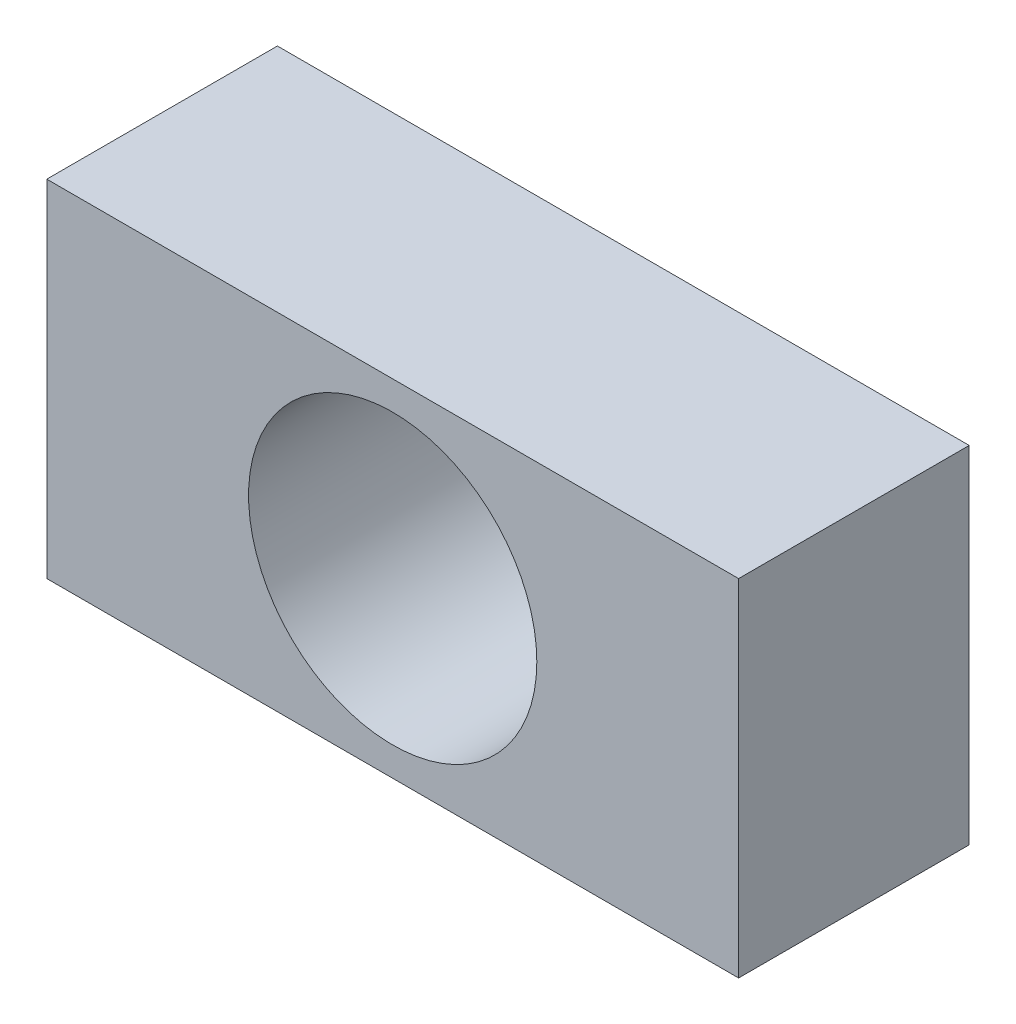
ISO-10303-21;
HEADER;
FILE_DESCRIPTION(('STEP AP214'),'2;1');
FILE_NAME('part.step','',(''),(''),'','','');
FILE_SCHEMA(('AUTOMOTIVE_DESIGN { 1 0 10303 214 1 1 1 1 }'));
ENDSEC;
DATA;
#1=APPLICATION_CONTEXT('core data for automotive mechanical design processes');
#2=APPLICATION_PROTOCOL_DEFINITION('international standard','automotive_design',2000,#1);
#3=PRODUCT_CONTEXT('',#1,'mechanical');
#4=PRODUCT('Part','Part','',(#3));
#5=PRODUCT_RELATED_PRODUCT_CATEGORY('part','',(#4));
#6=PRODUCT_DEFINITION_FORMATION('','',#4);
#7=PRODUCT_DEFINITION_CONTEXT('part definition',#1,'design');
#8=PRODUCT_DEFINITION('design','',#6,#7);
#9=PRODUCT_DEFINITION_SHAPE('','',#8);
#10=(LENGTH_UNIT() NAMED_UNIT(*) SI_UNIT(.MILLI.,.METRE.));
#11=(NAMED_UNIT(*) PLANE_ANGLE_UNIT() SI_UNIT($,.RADIAN.));
#12=(NAMED_UNIT(*) SI_UNIT($,.STERADIAN.) SOLID_ANGLE_UNIT());
#13=UNCERTAINTY_MEASURE_WITH_UNIT(LENGTH_MEASURE(1.E-05),#10,'distance_accuracy_value','');
#14=(GEOMETRIC_REPRESENTATION_CONTEXT(3) GLOBAL_UNCERTAINTY_ASSIGNED_CONTEXT((#13)) GLOBAL_UNIT_ASSIGNED_CONTEXT((#10,
#11,#12)) REPRESENTATION_CONTEXT('',''));
#15=CARTESIAN_POINT('',(0.,0.,0.));
#16=DIRECTION('',(0.,0.,1.));
#17=DIRECTION('',(1.,0.,0.));
#18=AXIS2_PLACEMENT_3D('',#15,#16,#17);
#19=CARTESIAN_POINT('',(0.,0.,20.));
#20=DIRECTION('',(0.,0.,1.));
#21=DIRECTION('',(1.,0.,0.));
#22=AXIS2_PLACEMENT_3D('',#19,#20,#21);
#23=PLANE('',#22);
#24=DIRECTION('',(0.,-1.,0.));
#25=VECTOR('',#24,1.);
#26=CARTESIAN_POINT('',(-27.4285714285714,18.,20.));
#27=LINE('',#26,#25);
#28=CARTESIAN_POINT('',(-27.4285714285714,18.,20.));
#29=VERTEX_POINT('',#28);
#30=CARTESIAN_POINT('',(-27.4285714285714,-12.,20.));
#31=VERTEX_POINT('',#30);
#32=EDGE_CURVE('E94',#29,#31,#27,.T.);
#33=ORIENTED_EDGE('',*,*,#32,.T.);
#34=DIRECTION('',(1.,0.,0.));
#35=VECTOR('',#34,1.);
#36=CARTESIAN_POINT('',(-27.4285714285714,-12.,20.));
#37=LINE('',#36,#35);
#38=CARTESIAN_POINT('',(32.5714285714286,-12.,20.));
#39=VERTEX_POINT('',#38);
#40=EDGE_CURVE('E89',#31,#39,#37,.T.);
#41=ORIENTED_EDGE('',*,*,#40,.T.);
#42=DIRECTION('',(0.,1.,0.));
#43=VECTOR('',#42,1.);
#44=CARTESIAN_POINT('',(32.5714285714286,18.,20.));
#45=LINE('',#44,#43);
#46=CARTESIAN_POINT('',(32.5714285714286,18.,20.));
#47=VERTEX_POINT('',#46);
#48=EDGE_CURVE('E92',#39,#47,#45,.T.);
#49=ORIENTED_EDGE('',*,*,#48,.T.);
#50=DIRECTION('',(-1.,0.,0.));
#51=VECTOR('',#50,1.);
#52=CARTESIAN_POINT('',(-27.4285714285714,18.,20.));
#53=LINE('',#52,#51);
#54=EDGE_CURVE('E59',#47,#29,#53,.T.);
#55=ORIENTED_EDGE('',*,*,#54,.T.);
#56=EDGE_LOOP('',(#33,#41,#49,#55));
#57=FACE_BOUND('',#56,.T.);
#58=CARTESIAN_POINT('',(2.57142857142858,2.99999999999999,20.));
#59=DIRECTION('',(0.,0.,1.));
#60=DIRECTION('',(1.,0.,0.));
#61=AXIS2_PLACEMENT_3D('',#58,#59,#60);
#62=CIRCLE('',#61,12.5);
#63=CARTESIAN_POINT('',(15.0714285714286,2.99999999999999,20.));
#64=VERTEX_POINT('',#63);
#65=EDGE_CURVE('E114',#64,#64,#62,.T.);
#66=ORIENTED_EDGE('',*,*,#65,.F.);
#67=EDGE_LOOP('',(#66));
#68=FACE_BOUND('',#67,.T.);
#69=ADVANCED_FACE('F41',(#57,#68),#23,.T.);
#70=CARTESIAN_POINT('',(0.,0.,0.));
#71=DIRECTION('',(0.,0.,1.));
#72=DIRECTION('',(1.,0.,0.));
#73=AXIS2_PLACEMENT_3D('',#70,#71,#72);
#74=PLANE('',#73);
#75=DIRECTION('',(0.,-1.,0.));
#76=VECTOR('',#75,1.);
#77=CARTESIAN_POINT('',(-27.4285714285714,18.,0.));
#78=LINE('',#77,#76);
#79=CARTESIAN_POINT('',(-27.4285714285714,18.,0.));
#80=VERTEX_POINT('',#79);
#81=CARTESIAN_POINT('',(-27.4285714285714,-12.,0.));
#82=VERTEX_POINT('',#81);
#83=EDGE_CURVE('E110',#80,#82,#78,.T.);
#84=ORIENTED_EDGE('',*,*,#83,.F.);
#85=DIRECTION('',(-1.,0.,0.));
#86=VECTOR('',#85,1.);
#87=CARTESIAN_POINT('',(-27.4285714285714,18.,0.));
#88=LINE('',#87,#86);
#89=CARTESIAN_POINT('',(32.5714285714286,18.,0.));
#90=VERTEX_POINT('',#89);
#91=EDGE_CURVE('E82',#90,#80,#88,.T.);
#92=ORIENTED_EDGE('',*,*,#91,.F.);
#93=DIRECTION('',(0.,1.,0.));
#94=VECTOR('',#93,1.);
#95=CARTESIAN_POINT('',(32.5714285714286,18.,0.));
#96=LINE('',#95,#94);
#97=CARTESIAN_POINT('',(32.5714285714286,-12.,0.));
#98=VERTEX_POINT('',#97);
#99=EDGE_CURVE('E76',#98,#90,#96,.T.);
#100=ORIENTED_EDGE('',*,*,#99,.F.);
#101=DIRECTION('',(1.,0.,0.));
#102=VECTOR('',#101,1.);
#103=CARTESIAN_POINT('',(-27.4285714285714,-12.,0.));
#104=LINE('',#103,#102);
#105=EDGE_CURVE('E99',#82,#98,#104,.T.);
#106=ORIENTED_EDGE('',*,*,#105,.F.);
#107=EDGE_LOOP('',(#84,#92,#100,#106));
#108=FACE_BOUND('',#107,.T.);
#109=CARTESIAN_POINT('',(2.57142857142858,2.99999999999999,0.));
#110=DIRECTION('',(0.,0.,1.));
#111=DIRECTION('',(1.,0.,0.));
#112=AXIS2_PLACEMENT_3D('',#109,#110,#111);
#113=CIRCLE('',#112,12.5);
#114=CARTESIAN_POINT('',(15.0714285714286,2.99999999999999,0.));
#115=VERTEX_POINT('',#114);
#116=EDGE_CURVE('E132',#115,#115,#113,.T.);
#117=ORIENTED_EDGE('',*,*,#116,.T.);
#118=EDGE_LOOP('',(#117));
#119=FACE_BOUND('',#118,.T.);
#120=ADVANCED_FACE('F127',(#108,#119),#74,.F.);
#121=CARTESIAN_POINT('',(-27.4285714285714,18.,20.));
#122=DIRECTION('',(1.,0.,0.));
#123=DIRECTION('',(0.,1.,0.));
#124=AXIS2_PLACEMENT_3D('',#121,#122,#123);
#125=PLANE('',#124);
#126=ORIENTED_EDGE('',*,*,#83,.T.);
#127=DIRECTION('',(0.,0.,-1.));
#128=VECTOR('',#127,1.);
#129=CARTESIAN_POINT('',(-27.4285714285714,-12.,20.));
#130=LINE('',#129,#128);
#131=EDGE_CURVE('E11',#31,#82,#130,.T.);
#132=ORIENTED_EDGE('',*,*,#131,.F.);
#133=ORIENTED_EDGE('',*,*,#32,.F.);
#134=DIRECTION('',(0.,0.,-1.));
#135=VECTOR('',#134,1.);
#136=CARTESIAN_POINT('',(-27.4285714285714,18.,20.));
#137=LINE('',#136,#135);
#138=EDGE_CURVE('E106',#29,#80,#137,.T.);
#139=ORIENTED_EDGE('',*,*,#138,.T.);
#140=EDGE_LOOP('',(#126,#132,#133,#139));
#141=FACE_BOUND('',#140,.T.);
#142=ADVANCED_FACE('F43',(#141),#125,.F.);
#143=CARTESIAN_POINT('',(-27.4285714285714,-12.,20.));
#144=DIRECTION('',(0.,1.,0.));
#145=DIRECTION('',(0.,0.,1.));
#146=AXIS2_PLACEMENT_3D('',#143,#144,#145);
#147=PLANE('',#146);
#148=CARTESIAN_POINT('',(-20.4285714285714,-12.,10.));
#149=DIRECTION('',(0.,-1.,0.));
#150=DIRECTION('',(0.,0.,-1.));
#151=AXIS2_PLACEMENT_3D('',#148,#149,#150);
#152=CIRCLE('',#151,4.);
#153=CARTESIAN_POINT('',(-20.4285714285714,-12.,6.));
#154=VERTEX_POINT('',#153);
#155=EDGE_CURVE('E148',#154,#154,#152,.T.);
#156=ORIENTED_EDGE('',*,*,#155,.F.);
#157=EDGE_LOOP('',(#156));
#158=FACE_BOUND('',#157,.T.);
#159=CARTESIAN_POINT('',(25.5714285714286,-12.,10.));
#160=DIRECTION('',(0.,-1.,0.));
#161=DIRECTION('',(0.,0.,-1.));
#162=AXIS2_PLACEMENT_3D('',#159,#160,#161);
#163=CIRCLE('',#162,4.);
#164=CARTESIAN_POINT('',(25.5714285714286,-12.,6.));
#165=VERTEX_POINT('',#164);
#166=EDGE_CURVE('E140',#165,#165,#163,.T.);
#167=ORIENTED_EDGE('',*,*,#166,.F.);
#168=EDGE_LOOP('',(#167));
#169=FACE_BOUND('',#168,.T.);
#170=ORIENTED_EDGE('',*,*,#105,.T.);
#171=DIRECTION('',(0.,0.,-1.));
#172=VECTOR('',#171,1.);
#173=CARTESIAN_POINT('',(32.5714285714286,-12.,20.));
#174=LINE('',#173,#172);
#175=EDGE_CURVE('E51',#39,#98,#174,.T.);
#176=ORIENTED_EDGE('',*,*,#175,.F.);
#177=ORIENTED_EDGE('',*,*,#40,.F.);
#178=ORIENTED_EDGE('',*,*,#131,.T.);
#179=EDGE_LOOP('',(#170,#176,#177,#178));
#180=FACE_BOUND('',#179,.T.);
#181=ADVANCED_FACE('F98',(#158,#169,#180),#147,.F.);
#182=CARTESIAN_POINT('',(32.5714285714286,18.,20.));
#183=DIRECTION('',(-1.,0.,0.));
#184=DIRECTION('',(0.,0.,1.));
#185=AXIS2_PLACEMENT_3D('',#182,#183,#184);
#186=PLANE('',#185);
#187=ORIENTED_EDGE('',*,*,#99,.T.);
#188=DIRECTION('',(0.,0.,-1.));
#189=VECTOR('',#188,1.);
#190=CARTESIAN_POINT('',(32.5714285714286,18.,20.));
#191=LINE('',#190,#189);
#192=EDGE_CURVE('E101',#47,#90,#191,.T.);
#193=ORIENTED_EDGE('',*,*,#192,.F.);
#194=ORIENTED_EDGE('',*,*,#48,.F.);
#195=ORIENTED_EDGE('',*,*,#175,.T.);
#196=EDGE_LOOP('',(#187,#193,#194,#195));
#197=FACE_BOUND('',#196,.T.);
#198=ADVANCED_FACE('F102',(#197),#186,.F.);
#199=CARTESIAN_POINT('',(-27.4285714285714,18.,20.));
#200=DIRECTION('',(0.,-1.,0.));
#201=DIRECTION('',(0.,0.,-1.));
#202=AXIS2_PLACEMENT_3D('',#199,#200,#201);
#203=PLANE('',#202);
#204=ORIENTED_EDGE('',*,*,#91,.T.);
#205=ORIENTED_EDGE('',*,*,#138,.F.);
#206=ORIENTED_EDGE('',*,*,#54,.F.);
#207=ORIENTED_EDGE('',*,*,#192,.T.);
#208=EDGE_LOOP('',(#204,#205,#206,#207));
#209=FACE_BOUND('',#208,.T.);
#210=ADVANCED_FACE('F124',(#209),#203,.F.);
#211=CARTESIAN_POINT('',(2.57142857142858,2.99999999999999,20.));
#212=DIRECTION('',(0.,0.,-1.));
#213=DIRECTION('',(-1.,0.,0.));
#214=AXIS2_PLACEMENT_3D('',#211,#212,#213);
#215=CYLINDRICAL_SURFACE('',#214,12.5);
#216=ORIENTED_EDGE('',*,*,#65,.T.);
#217=EDGE_LOOP('',(#216));
#218=FACE_BOUND('',#217,.T.);
#219=ORIENTED_EDGE('',*,*,#116,.F.);
#220=EDGE_LOOP('',(#219));
#221=FACE_BOUND('',#220,.T.);
#222=ADVANCED_FACE('F171',(#218,#221),#215,.F.);
#223=CARTESIAN_POINT('',(25.5714285714286,-2.00000000000001,10.));
#224=DIRECTION('',(0.,-1.,0.));
#225=DIRECTION('',(0.,0.,-1.));
#226=AXIS2_PLACEMENT_3D('',#223,#224,#225);
#227=CYLINDRICAL_SURFACE('',#226,4.);
#228=CARTESIAN_POINT('',(25.5714285714286,-2.00000000000001,10.));
#229=DIRECTION('',(0.,-1.,0.));
#230=DIRECTION('',(0.,0.,-1.));
#231=AXIS2_PLACEMENT_3D('',#228,#229,#230);
#232=CIRCLE('',#231,4.);
#233=CARTESIAN_POINT('',(25.5714285714286,-2.00000000000001,6.));
#234=VERTEX_POINT('',#233);
#235=EDGE_CURVE('E144',#234,#234,#232,.T.);
#236=ORIENTED_EDGE('',*,*,#235,.F.);
#237=EDGE_LOOP('',(#236));
#238=FACE_BOUND('',#237,.T.);
#239=ORIENTED_EDGE('',*,*,#166,.T.);
#240=EDGE_LOOP('',(#239));
#241=FACE_BOUND('',#240,.T.);
#242=ADVANCED_FACE('F169',(#238,#241),#227,.F.);
#243=CARTESIAN_POINT('',(25.5714285714286,-2.00000000000001,10.));
#244=DIRECTION('',(0.,-1.,0.));
#245=DIRECTION('',(0.,0.,-1.));
#246=AXIS2_PLACEMENT_3D('',#243,#244,#245);
#247=PLANE('',#246);
#248=ORIENTED_EDGE('',*,*,#235,.T.);
#249=EDGE_LOOP('',(#248));
#250=FACE_BOUND('',#249,.T.);
#251=ADVANCED_FACE('F161',(#250),#247,.T.);
#252=CARTESIAN_POINT('',(-20.4285714285714,-2.00000000000001,10.));
#253=DIRECTION('',(0.,-1.,0.));
#254=DIRECTION('',(0.,0.,-1.));
#255=AXIS2_PLACEMENT_3D('',#252,#253,#254);
#256=CYLINDRICAL_SURFACE('',#255,4.);
#257=CARTESIAN_POINT('',(-20.4285714285714,-2.00000000000001,10.));
#258=DIRECTION('',(0.,-1.,0.));
#259=DIRECTION('',(0.,0.,-1.));
#260=AXIS2_PLACEMENT_3D('',#257,#258,#259);
#261=CIRCLE('',#260,4.);
#262=CARTESIAN_POINT('',(-20.4285714285714,-2.00000000000001,6.));
#263=VERTEX_POINT('',#262);
#264=EDGE_CURVE('E136',#263,#263,#261,.T.);
#265=ORIENTED_EDGE('',*,*,#264,.F.);
#266=EDGE_LOOP('',(#265));
#267=FACE_BOUND('',#266,.T.);
#268=ORIENTED_EDGE('',*,*,#155,.T.);
#269=EDGE_LOOP('',(#268));
#270=FACE_BOUND('',#269,.T.);
#271=ADVANCED_FACE('F158',(#267,#270),#256,.F.);
#272=CARTESIAN_POINT('',(-20.4285714285714,-2.00000000000001,10.));
#273=DIRECTION('',(0.,-1.,0.));
#274=DIRECTION('',(0.,0.,-1.));
#275=AXIS2_PLACEMENT_3D('',#272,#273,#274);
#276=PLANE('',#275);
#277=ORIENTED_EDGE('',*,*,#264,.T.);
#278=EDGE_LOOP('',(#277));
#279=FACE_BOUND('',#278,.T.);
#280=ADVANCED_FACE('F156',(#279),#276,.T.);
#281=CLOSED_SHELL('',(#69,#120,#142,#181,#198,#210,#222,#242,#251,#271,#280));
#282=MANIFOLD_SOLID_BREP('B2',#281);
#283=ADVANCED_BREP_SHAPE_REPRESENTATION('',(#18,#282),#14);
#284=SHAPE_DEFINITION_REPRESENTATION(#9,#283);
ENDSEC;
END-ISO-10303-21;
